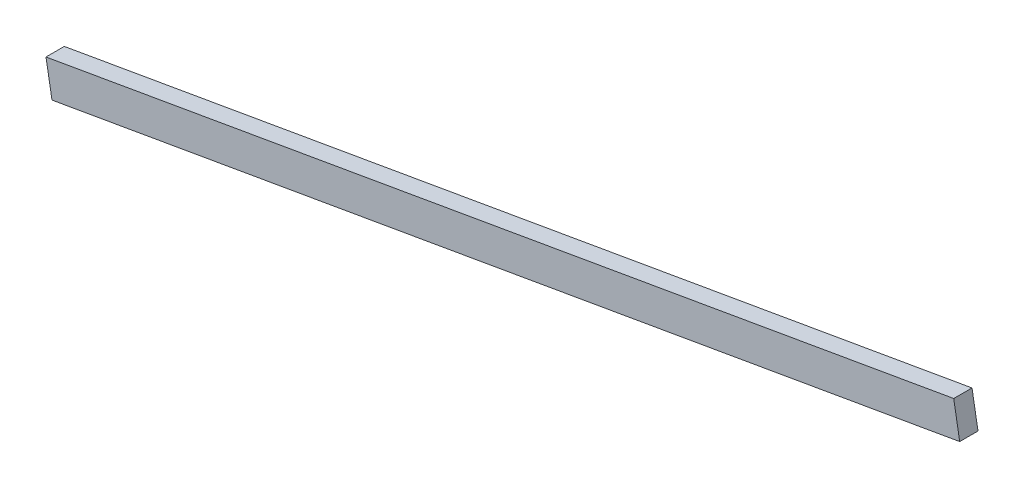
ISO-10303-21;
HEADER;
FILE_DESCRIPTION(('STEP AP214'),'2;1');
FILE_NAME('part.step','',(''),(''),'','','');
FILE_SCHEMA(('AUTOMOTIVE_DESIGN { 1 0 10303 214 1 1 1 1 }'));
ENDSEC;
DATA;
#1=APPLICATION_CONTEXT('core data for automotive mechanical design processes');
#2=APPLICATION_PROTOCOL_DEFINITION('international standard','automotive_design',2000,#1);
#3=PRODUCT_CONTEXT('',#1,'mechanical');
#4=PRODUCT('Part','Part','',(#3));
#5=PRODUCT_RELATED_PRODUCT_CATEGORY('part','',(#4));
#6=PRODUCT_DEFINITION_FORMATION('','',#4);
#7=PRODUCT_DEFINITION_CONTEXT('part definition',#1,'design');
#8=PRODUCT_DEFINITION('design','',#6,#7);
#9=PRODUCT_DEFINITION_SHAPE('','',#8);
#10=(LENGTH_UNIT() NAMED_UNIT(*) SI_UNIT(.MILLI.,.METRE.));
#11=(NAMED_UNIT(*) PLANE_ANGLE_UNIT() SI_UNIT($,.RADIAN.));
#12=(NAMED_UNIT(*) SI_UNIT($,.STERADIAN.) SOLID_ANGLE_UNIT());
#13=UNCERTAINTY_MEASURE_WITH_UNIT(LENGTH_MEASURE(1.E-05),#10,'distance_accuracy_value','');
#14=(GEOMETRIC_REPRESENTATION_CONTEXT(3) GLOBAL_UNCERTAINTY_ASSIGNED_CONTEXT((#13)) GLOBAL_UNIT_ASSIGNED_CONTEXT((#10,
#11,#12)) REPRESENTATION_CONTEXT('',''));
#15=CARTESIAN_POINT('',(0.,0.,0.));
#16=DIRECTION('',(0.,0.,1.));
#17=DIRECTION('',(1.,0.,0.));
#18=AXIS2_PLACEMENT_3D('',#15,#16,#17);
#19=CARTESIAN_POINT('',(-1.74317994204094,-160.226043692394,5.334));
#20=DIRECTION('',(0.985171439075032,0.171572828941037,0.));
#21=DIRECTION('',(-0.171572828941037,0.985171439075032,0.));
#22=AXIS2_PLACEMENT_3D('',#19,#20,#21);
#23=PLANE('',#22);
#24=DIRECTION('',(0.171572828941037,-0.985171439075032,0.));
#25=VECTOR('',#24,1.);
#26=CARTESIAN_POINT('',(-1.74317994204094,-160.226043692394,0.));
#27=LINE('',#26,#25);
#28=CARTESIAN_POINT('',(-1.74317994204094,-160.226043692394,0.));
#29=VERTEX_POINT('',#28);
#30=CARTESIAN_POINT('',(0.,-170.235385513396,0.));
#31=VERTEX_POINT('',#30);
#32=EDGE_CURVE('E98',#29,#31,#27,.T.);
#33=ORIENTED_EDGE('',*,*,#32,.T.);
#34=DIRECTION('',(0.,0.,-1.));
#35=VECTOR('',#34,1.);
#36=CARTESIAN_POINT('',(0.,-170.235385513396,5.334));
#37=LINE('',#36,#35);
#38=CARTESIAN_POINT('',(0.,-170.235385513396,5.334));
#39=VERTEX_POINT('',#38);
#40=EDGE_CURVE('E11',#39,#31,#37,.T.);
#41=ORIENTED_EDGE('',*,*,#40,.F.);
#42=DIRECTION('',(0.171572828941037,-0.985171439075032,0.));
#43=VECTOR('',#42,1.);
#44=CARTESIAN_POINT('',(-1.74317994204094,-160.226043692394,5.334));
#45=LINE('',#44,#43);
#46=CARTESIAN_POINT('',(-1.74317994204094,-160.226043692394,5.334));
#47=VERTEX_POINT('',#46);
#48=EDGE_CURVE('E86',#47,#39,#45,.T.);
#49=ORIENTED_EDGE('',*,*,#48,.F.);
#50=DIRECTION('',(0.,0.,-1.));
#51=VECTOR('',#50,1.);
#52=CARTESIAN_POINT('',(-1.74317994204094,-160.226043692394,5.334));
#53=LINE('',#52,#51);
#54=EDGE_CURVE('E94',#47,#29,#53,.T.);
#55=ORIENTED_EDGE('',*,*,#54,.T.);
#56=EDGE_LOOP('',(#33,#41,#49,#55));
#57=FACE_BOUND('',#56,.T.);
#58=ADVANCED_FACE('F35',(#57),#23,.F.);
#59=CARTESIAN_POINT('',(0.,-170.235385513396,5.334));
#60=DIRECTION('',(-0.171572828941037,0.985171439075032,0.));
#61=DIRECTION('',(-0.985171439075032,-0.171572828941037,0.));
#62=AXIS2_PLACEMENT_3D('',#59,#60,#61);
#63=PLANE('',#62);
#64=DIRECTION('',(0.985171439075032,0.171572828941037,0.));
#65=VECTOR('',#64,1.);
#66=CARTESIAN_POINT('',(0.,-170.235385513396,0.));
#67=LINE('',#66,#65);
#68=CARTESIAN_POINT('',(264.564463463203,-124.16008162896,0.));
#69=VERTEX_POINT('',#68);
#70=EDGE_CURVE('E90',#31,#69,#67,.T.);
#71=ORIENTED_EDGE('',*,*,#70,.T.);
#72=DIRECTION('',(0.,0.,-1.));
#73=VECTOR('',#72,1.);
#74=CARTESIAN_POINT('',(264.564463463203,-124.16008162896,5.334));
#75=LINE('',#74,#73);
#76=CARTESIAN_POINT('',(264.564463463203,-124.16008162896,5.334));
#77=VERTEX_POINT('',#76);
#78=EDGE_CURVE('E43',#77,#69,#75,.T.);
#79=ORIENTED_EDGE('',*,*,#78,.F.);
#80=DIRECTION('',(0.985171439075032,0.171572828941037,0.));
#81=VECTOR('',#80,1.);
#82=CARTESIAN_POINT('',(0.,-170.235385513396,5.334));
#83=LINE('',#82,#81);
#84=EDGE_CURVE('E81',#39,#77,#83,.T.);
#85=ORIENTED_EDGE('',*,*,#84,.F.);
#86=ORIENTED_EDGE('',*,*,#40,.T.);
#87=EDGE_LOOP('',(#71,#79,#85,#86));
#88=FACE_BOUND('',#87,.T.);
#89=ADVANCED_FACE('F89',(#88),#63,.F.);
#90=CARTESIAN_POINT('',(262.821283521162,-114.150739807957,5.334));
#91=DIRECTION('',(-0.985171439075032,-0.171572828941036,0.));
#92=DIRECTION('',(0.171572828941036,-0.985171439075032,0.));
#93=AXIS2_PLACEMENT_3D('',#90,#91,#92);
#94=PLANE('',#93);
#95=DIRECTION('',(-0.171572828941036,0.985171439075032,0.));
#96=VECTOR('',#95,1.);
#97=CARTESIAN_POINT('',(262.821283521162,-114.150739807957,0.));
#98=LINE('',#97,#96);
#99=CARTESIAN_POINT('',(262.821283521162,-114.150739807957,0.));
#100=VERTEX_POINT('',#99);
#101=EDGE_CURVE('E68',#69,#100,#98,.T.);
#102=ORIENTED_EDGE('',*,*,#101,.T.);
#103=DIRECTION('',(0.,0.,-1.));
#104=VECTOR('',#103,1.);
#105=CARTESIAN_POINT('',(262.821283521162,-114.150739807957,5.334));
#106=LINE('',#105,#104);
#107=CARTESIAN_POINT('',(262.821283521162,-114.150739807957,5.334));
#108=VERTEX_POINT('',#107);
#109=EDGE_CURVE('E91',#108,#100,#106,.T.);
#110=ORIENTED_EDGE('',*,*,#109,.F.);
#111=DIRECTION('',(-0.171572828941036,0.985171439075032,0.));
#112=VECTOR('',#111,1.);
#113=CARTESIAN_POINT('',(262.821283521162,-114.150739807957,5.334));
#114=LINE('',#113,#112);
#115=EDGE_CURVE('E84',#77,#108,#114,.T.);
#116=ORIENTED_EDGE('',*,*,#115,.F.);
#117=ORIENTED_EDGE('',*,*,#78,.T.);
#118=EDGE_LOOP('',(#102,#110,#116,#117));
#119=FACE_BOUND('',#118,.T.);
#120=ADVANCED_FACE('F92',(#119),#94,.F.);
#121=CARTESIAN_POINT('',(-1.74317994204094,-160.226043692394,5.334));
#122=DIRECTION('',(0.171572828941037,-0.985171439075032,0.));
#123=DIRECTION('',(0.985171439075032,0.171572828941037,0.));
#124=AXIS2_PLACEMENT_3D('',#121,#122,#123);
#125=PLANE('',#124);
#126=DIRECTION('',(-0.985171439075032,-0.171572828941037,0.));
#127=VECTOR('',#126,1.);
#128=CARTESIAN_POINT('',(-1.74317994204094,-160.226043692394,0.));
#129=LINE('',#128,#127);
#130=EDGE_CURVE('E74',#100,#29,#129,.T.);
#131=ORIENTED_EDGE('',*,*,#130,.T.);
#132=ORIENTED_EDGE('',*,*,#54,.F.);
#133=DIRECTION('',(-0.985171439075032,-0.171572828941037,0.));
#134=VECTOR('',#133,1.);
#135=CARTESIAN_POINT('',(-1.74317994204094,-160.226043692394,5.334));
#136=LINE('',#135,#134);
#137=EDGE_CURVE('E51',#108,#47,#136,.T.);
#138=ORIENTED_EDGE('',*,*,#137,.F.);
#139=ORIENTED_EDGE('',*,*,#109,.T.);
#140=EDGE_LOOP('',(#131,#132,#138,#139));
#141=FACE_BOUND('',#140,.T.);
#142=ADVANCED_FACE('F105',(#141),#125,.F.);
#143=CARTESIAN_POINT('',(0.,0.,5.334));
#144=DIRECTION('',(0.,0.,1.));
#145=DIRECTION('',(1.,0.,0.));
#146=AXIS2_PLACEMENT_3D('',#143,#144,#145);
#147=PLANE('',#146);
#148=ORIENTED_EDGE('',*,*,#48,.T.);
#149=ORIENTED_EDGE('',*,*,#84,.T.);
#150=ORIENTED_EDGE('',*,*,#115,.T.);
#151=ORIENTED_EDGE('',*,*,#137,.T.);
#152=EDGE_LOOP('',(#148,#149,#150,#151));
#153=FACE_BOUND('',#152,.T.);
#154=ADVANCED_FACE('F82',(#153),#147,.T.);
#155=CARTESIAN_POINT('',(0.,0.,0.));
#156=DIRECTION('',(0.,0.,1.));
#157=DIRECTION('',(1.,0.,0.));
#158=AXIS2_PLACEMENT_3D('',#155,#156,#157);
#159=PLANE('',#158);
#160=ORIENTED_EDGE('',*,*,#32,.F.);
#161=ORIENTED_EDGE('',*,*,#130,.F.);
#162=ORIENTED_EDGE('',*,*,#101,.F.);
#163=ORIENTED_EDGE('',*,*,#70,.F.);
#164=EDGE_LOOP('',(#160,#161,#162,#163));
#165=FACE_BOUND('',#164,.T.);
#166=ADVANCED_FACE('F108',(#165),#159,.F.);
#167=CLOSED_SHELL('',(#58,#89,#120,#142,#154,#166));
#168=MANIFOLD_SOLID_BREP('B2',#167);
#169=ADVANCED_BREP_SHAPE_REPRESENTATION('',(#18,#168),#14);
#170=SHAPE_DEFINITION_REPRESENTATION(#9,#169);
ENDSEC;
END-ISO-10303-21;
